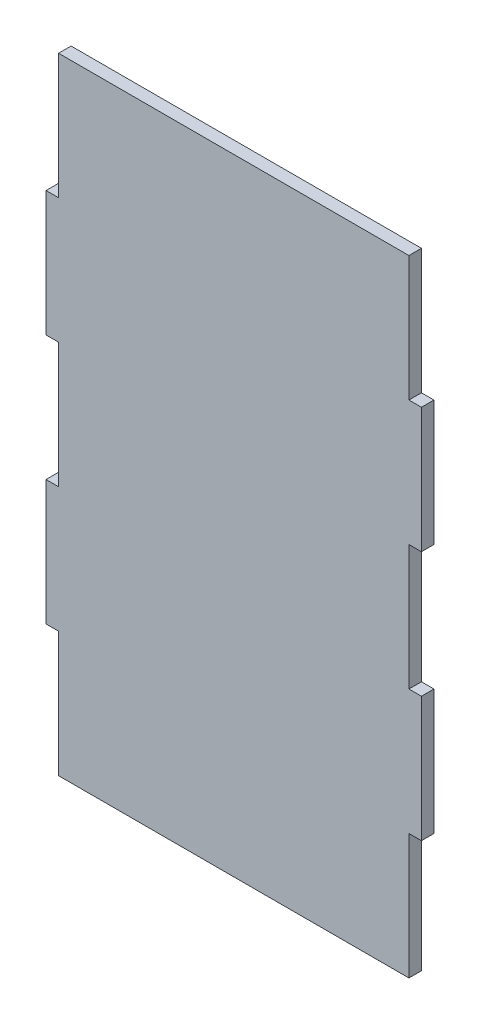
ISO-10303-21;
HEADER;
FILE_DESCRIPTION(('STEP AP214'),'2;1');
FILE_NAME('part.step','',(''),(''),'','','');
FILE_SCHEMA(('AUTOMOTIVE_DESIGN { 1 0 10303 214 1 1 1 1 }'));
ENDSEC;
DATA;
#1=APPLICATION_CONTEXT('core data for automotive mechanical design processes');
#2=APPLICATION_PROTOCOL_DEFINITION('international standard','automotive_design',2000,#1);
#3=PRODUCT_CONTEXT('',#1,'mechanical');
#4=PRODUCT('Part','Part','',(#3));
#5=PRODUCT_RELATED_PRODUCT_CATEGORY('part','',(#4));
#6=PRODUCT_DEFINITION_FORMATION('','',#4);
#7=PRODUCT_DEFINITION_CONTEXT('part definition',#1,'design');
#8=PRODUCT_DEFINITION('design','',#6,#7);
#9=PRODUCT_DEFINITION_SHAPE('','',#8);
#10=(LENGTH_UNIT() NAMED_UNIT(*) SI_UNIT(.MILLI.,.METRE.));
#11=(NAMED_UNIT(*) PLANE_ANGLE_UNIT() SI_UNIT($,.RADIAN.));
#12=(NAMED_UNIT(*) SI_UNIT($,.STERADIAN.) SOLID_ANGLE_UNIT());
#13=UNCERTAINTY_MEASURE_WITH_UNIT(LENGTH_MEASURE(1.E-05),#10,'distance_accuracy_value','');
#14=(GEOMETRIC_REPRESENTATION_CONTEXT(3) GLOBAL_UNCERTAINTY_ASSIGNED_CONTEXT((#13)) GLOBAL_UNIT_ASSIGNED_CONTEXT((#10,
#11,#12)) REPRESENTATION_CONTEXT('',''));
#15=CARTESIAN_POINT('',(0.,0.,0.));
#16=DIRECTION('',(0.,0.,1.));
#17=DIRECTION('',(1.,0.,0.));
#18=AXIS2_PLACEMENT_3D('',#15,#16,#17);
#19=CARTESIAN_POINT('',(0.,0.,2.54));
#20=DIRECTION('',(0.,0.,1.));
#21=DIRECTION('',(1.,0.,0.));
#22=AXIS2_PLACEMENT_3D('',#19,#20,#21);
#23=PLANE('',#22);
#24=DIRECTION('',(0.,1.,0.));
#25=VECTOR('',#24,1.);
#26=CARTESIAN_POINT('',(76.2,0.,2.54));
#27=LINE('',#26,#25);
#28=CARTESIAN_POINT('',(76.2,76.2,2.54));
#29=VERTEX_POINT('',#28);
#30=CARTESIAN_POINT('',(76.2,101.6,2.54));
#31=VERTEX_POINT('',#30);
#32=EDGE_CURVE('E219',#29,#31,#27,.T.);
#33=ORIENTED_EDGE('',*,*,#32,.T.);
#34=DIRECTION('',(-1.,0.,0.));
#35=VECTOR('',#34,1.);
#36=CARTESIAN_POINT('',(76.2,101.6,2.54));
#37=LINE('',#36,#35);
#38=CARTESIAN_POINT('',(73.66,101.6,2.54));
#39=VERTEX_POINT('',#38);
#40=EDGE_CURVE('E54',#31,#39,#37,.T.);
#41=ORIENTED_EDGE('',*,*,#40,.T.);
#42=DIRECTION('',(0.,-1.,0.));
#43=VECTOR('',#42,1.);
#44=CARTESIAN_POINT('',(73.66,127.,2.54));
#45=LINE('',#44,#43);
#46=CARTESIAN_POINT('',(73.66,127.,2.54));
#47=VERTEX_POINT('',#46);
#48=EDGE_CURVE('E193',#47,#39,#45,.T.);
#49=ORIENTED_EDGE('',*,*,#48,.F.);
#50=DIRECTION('',(1.,0.,0.));
#51=VECTOR('',#50,1.);
#52=CARTESIAN_POINT('',(0.,127.,2.54));
#53=LINE('',#52,#51);
#54=CARTESIAN_POINT('',(2.54,127.,2.54));
#55=VERTEX_POINT('',#54);
#56=EDGE_CURVE('E231',#55,#47,#53,.T.);
#57=ORIENTED_EDGE('',*,*,#56,.F.);
#58=DIRECTION('',(0.,-1.,0.));
#59=VECTOR('',#58,1.);
#60=CARTESIAN_POINT('',(2.54,127.,2.54));
#61=LINE('',#60,#59);
#62=CARTESIAN_POINT('',(2.54,101.6,2.54));
#63=VERTEX_POINT('',#62);
#64=EDGE_CURVE('E252',#55,#63,#61,.T.);
#65=ORIENTED_EDGE('',*,*,#64,.T.);
#66=DIRECTION('',(1.,0.,0.));
#67=VECTOR('',#66,1.);
#68=CARTESIAN_POINT('',(0.,101.6,2.54));
#69=LINE('',#68,#67);
#70=CARTESIAN_POINT('',(0.,101.6,2.54));
#71=VERTEX_POINT('',#70);
#72=EDGE_CURVE('E246',#71,#63,#69,.T.);
#73=ORIENTED_EDGE('',*,*,#72,.F.);
#74=DIRECTION('',(0.,1.,0.));
#75=VECTOR('',#74,1.);
#76=CARTESIAN_POINT('',(0.,0.,2.54));
#77=LINE('',#76,#75);
#78=CARTESIAN_POINT('',(0.,76.2,2.54));
#79=VERTEX_POINT('',#78);
#80=EDGE_CURVE('E46',#79,#71,#77,.T.);
#81=ORIENTED_EDGE('',*,*,#80,.F.);
#82=DIRECTION('',(1.,0.,0.));
#83=VECTOR('',#82,1.);
#84=CARTESIAN_POINT('',(0.,76.2,2.54));
#85=LINE('',#84,#83);
#86=CARTESIAN_POINT('',(2.54,76.2,2.54));
#87=VERTEX_POINT('',#86);
#88=EDGE_CURVE('E323',#79,#87,#85,.T.);
#89=ORIENTED_EDGE('',*,*,#88,.T.);
#90=DIRECTION('',(0.,-1.,0.));
#91=VECTOR('',#90,1.);
#92=CARTESIAN_POINT('',(2.54,76.2,2.54));
#93=LINE('',#92,#91);
#94=CARTESIAN_POINT('',(2.54,50.8,2.54));
#95=VERTEX_POINT('',#94);
#96=EDGE_CURVE('E332',#87,#95,#93,.T.);
#97=ORIENTED_EDGE('',*,*,#96,.T.);
#98=DIRECTION('',(1.,0.,0.));
#99=VECTOR('',#98,1.);
#100=CARTESIAN_POINT('',(0.,50.8,2.54));
#101=LINE('',#100,#99);
#102=CARTESIAN_POINT('',(0.,50.8,2.54));
#103=VERTEX_POINT('',#102);
#104=EDGE_CURVE('E277',#103,#95,#101,.T.);
#105=ORIENTED_EDGE('',*,*,#104,.F.);
#106=CARTESIAN_POINT('',(0.,25.4,2.54));
#107=VERTEX_POINT('',#106);
#108=EDGE_CURVE('E11',#107,#103,#77,.T.);
#109=ORIENTED_EDGE('',*,*,#108,.F.);
#110=DIRECTION('',(1.,0.,0.));
#111=VECTOR('',#110,1.);
#112=CARTESIAN_POINT('',(0.,25.4,2.54));
#113=LINE('',#112,#111);
#114=CARTESIAN_POINT('',(2.54,25.4,2.54));
#115=VERTEX_POINT('',#114);
#116=EDGE_CURVE('E274',#107,#115,#113,.T.);
#117=ORIENTED_EDGE('',*,*,#116,.T.);
#118=DIRECTION('',(0.,1.,0.));
#119=VECTOR('',#118,1.);
#120=CARTESIAN_POINT('',(2.54,0.,2.54));
#121=LINE('',#120,#119);
#122=CARTESIAN_POINT('',(2.54,0.,2.54));
#123=VERTEX_POINT('',#122);
#124=EDGE_CURVE('E270',#123,#115,#121,.T.);
#125=ORIENTED_EDGE('',*,*,#124,.F.);
#126=DIRECTION('',(1.,0.,0.));
#127=VECTOR('',#126,1.);
#128=CARTESIAN_POINT('',(0.,0.,2.54));
#129=LINE('',#128,#127);
#130=CARTESIAN_POINT('',(73.66,0.,2.54));
#131=VERTEX_POINT('',#130);
#132=EDGE_CURVE('E214',#123,#131,#129,.T.);
#133=ORIENTED_EDGE('',*,*,#132,.T.);
#134=DIRECTION('',(0.,1.,0.));
#135=VECTOR('',#134,1.);
#136=CARTESIAN_POINT('',(73.66,0.,2.54));
#137=LINE('',#136,#135);
#138=CARTESIAN_POINT('',(73.66,25.4,2.54));
#139=VERTEX_POINT('',#138);
#140=EDGE_CURVE('E285',#131,#139,#137,.T.);
#141=ORIENTED_EDGE('',*,*,#140,.T.);
#142=DIRECTION('',(-1.,0.,0.));
#143=VECTOR('',#142,1.);
#144=CARTESIAN_POINT('',(76.2,25.4,2.54));
#145=LINE('',#144,#143);
#146=CARTESIAN_POINT('',(76.2,25.4,2.54));
#147=VERTEX_POINT('',#146);
#148=EDGE_CURVE('E289',#147,#139,#145,.T.);
#149=ORIENTED_EDGE('',*,*,#148,.F.);
#150=CARTESIAN_POINT('',(76.2,50.8,2.54));
#151=VERTEX_POINT('',#150);
#152=EDGE_CURVE('E225',#147,#151,#27,.T.);
#153=ORIENTED_EDGE('',*,*,#152,.T.);
#154=DIRECTION('',(-1.,0.,0.));
#155=VECTOR('',#154,1.);
#156=CARTESIAN_POINT('',(76.2,50.8,2.54));
#157=LINE('',#156,#155);
#158=CARTESIAN_POINT('',(73.66,50.8,2.54));
#159=VERTEX_POINT('',#158);
#160=EDGE_CURVE('E300',#151,#159,#157,.T.);
#161=ORIENTED_EDGE('',*,*,#160,.T.);
#162=DIRECTION('',(0.,1.,0.));
#163=VECTOR('',#162,1.);
#164=CARTESIAN_POINT('',(73.66,50.8,2.54));
#165=LINE('',#164,#163);
#166=CARTESIAN_POINT('',(73.66,76.2,2.54));
#167=VERTEX_POINT('',#166);
#168=EDGE_CURVE('E310',#159,#167,#165,.T.);
#169=ORIENTED_EDGE('',*,*,#168,.T.);
#170=DIRECTION('',(-1.,0.,0.));
#171=VECTOR('',#170,1.);
#172=CARTESIAN_POINT('',(76.2,76.2,2.54));
#173=LINE('',#172,#171);
#174=EDGE_CURVE('E306',#29,#167,#173,.T.);
#175=ORIENTED_EDGE('',*,*,#174,.F.);
#176=EDGE_LOOP('',(#33,#41,#49,#57,#65,#73,#81,#89,#97,#105,#109,#117,#125,#133,#141,#149,#153,
#161,#169,#175));
#177=FACE_BOUND('',#176,.T.);
#178=ADVANCED_FACE('F37',(#177),#23,.T.);
#179=CARTESIAN_POINT('',(0.,0.,0.));
#180=DIRECTION('',(0.,0.,1.));
#181=DIRECTION('',(1.,0.,0.));
#182=AXIS2_PLACEMENT_3D('',#179,#180,#181);
#183=PLANE('',#182);
#184=DIRECTION('',(-1.,0.,0.));
#185=VECTOR('',#184,1.);
#186=CARTESIAN_POINT('',(76.2,101.6,0.));
#187=LINE('',#186,#185);
#188=CARTESIAN_POINT('',(76.2,101.6,0.));
#189=VERTEX_POINT('',#188);
#190=CARTESIAN_POINT('',(73.66,101.6,0.));
#191=VERTEX_POINT('',#190);
#192=EDGE_CURVE('E176',#189,#191,#187,.T.);
#193=ORIENTED_EDGE('',*,*,#192,.F.);
#194=DIRECTION('',(0.,1.,0.));
#195=VECTOR('',#194,1.);
#196=CARTESIAN_POINT('',(76.2,0.,0.));
#197=LINE('',#196,#195);
#198=CARTESIAN_POINT('',(76.2,76.2,0.));
#199=VERTEX_POINT('',#198);
#200=EDGE_CURVE('E190',#199,#189,#197,.T.);
#201=ORIENTED_EDGE('',*,*,#200,.F.);
#202=DIRECTION('',(-1.,0.,0.));
#203=VECTOR('',#202,1.);
#204=CARTESIAN_POINT('',(76.2,76.2,0.));
#205=LINE('',#204,#203);
#206=CARTESIAN_POINT('',(73.66,76.2,0.));
#207=VERTEX_POINT('',#206);
#208=EDGE_CURVE('E298',#199,#207,#205,.T.);
#209=ORIENTED_EDGE('',*,*,#208,.T.);
#210=DIRECTION('',(0.,1.,0.));
#211=VECTOR('',#210,1.);
#212=CARTESIAN_POINT('',(73.66,50.8,0.));
#213=LINE('',#212,#211);
#214=CARTESIAN_POINT('',(73.66,50.8,0.));
#215=VERTEX_POINT('',#214);
#216=EDGE_CURVE('E301',#215,#207,#213,.T.);
#217=ORIENTED_EDGE('',*,*,#216,.F.);
#218=DIRECTION('',(-1.,0.,0.));
#219=VECTOR('',#218,1.);
#220=CARTESIAN_POINT('',(76.2,50.8,0.));
#221=LINE('',#220,#219);
#222=CARTESIAN_POINT('',(76.2,50.8,0.));
#223=VERTEX_POINT('',#222);
#224=EDGE_CURVE('E303',#223,#215,#221,.T.);
#225=ORIENTED_EDGE('',*,*,#224,.F.);
#226=CARTESIAN_POINT('',(76.2,25.4,0.));
#227=VERTEX_POINT('',#226);
#228=EDGE_CURVE('E198',#227,#223,#197,.T.);
#229=ORIENTED_EDGE('',*,*,#228,.F.);
#230=DIRECTION('',(-1.,0.,0.));
#231=VECTOR('',#230,1.);
#232=CARTESIAN_POINT('',(76.2,25.4,0.));
#233=LINE('',#232,#231);
#234=CARTESIAN_POINT('',(73.66,25.4,0.));
#235=VERTEX_POINT('',#234);
#236=EDGE_CURVE('E282',#227,#235,#233,.T.);
#237=ORIENTED_EDGE('',*,*,#236,.T.);
#238=DIRECTION('',(0.,1.,0.));
#239=VECTOR('',#238,1.);
#240=CARTESIAN_POINT('',(73.66,0.,0.));
#241=LINE('',#240,#239);
#242=CARTESIAN_POINT('',(73.66,0.,0.));
#243=VERTEX_POINT('',#242);
#244=EDGE_CURVE('E286',#243,#235,#241,.T.);
#245=ORIENTED_EDGE('',*,*,#244,.F.);
#246=DIRECTION('',(1.,0.,0.));
#247=VECTOR('',#246,1.);
#248=CARTESIAN_POINT('',(0.,0.,0.));
#249=LINE('',#248,#247);
#250=CARTESIAN_POINT('',(2.54,0.,0.));
#251=VERTEX_POINT('',#250);
#252=EDGE_CURVE('E199',#251,#243,#249,.T.);
#253=ORIENTED_EDGE('',*,*,#252,.F.);
#254=DIRECTION('',(0.,1.,0.));
#255=VECTOR('',#254,1.);
#256=CARTESIAN_POINT('',(2.54,0.,0.));
#257=LINE('',#256,#255);
#258=CARTESIAN_POINT('',(2.54,25.4,0.));
#259=VERTEX_POINT('',#258);
#260=EDGE_CURVE('E269',#251,#259,#257,.T.);
#261=ORIENTED_EDGE('',*,*,#260,.T.);
#262=DIRECTION('',(1.,0.,0.));
#263=VECTOR('',#262,1.);
#264=CARTESIAN_POINT('',(0.,25.4,0.));
#265=LINE('',#264,#263);
#266=CARTESIAN_POINT('',(0.,25.4,0.));
#267=VERTEX_POINT('',#266);
#268=EDGE_CURVE('E273',#267,#259,#265,.T.);
#269=ORIENTED_EDGE('',*,*,#268,.F.);
#270=DIRECTION('',(0.,1.,0.));
#271=VECTOR('',#270,1.);
#272=CARTESIAN_POINT('',(0.,0.,0.));
#273=LINE('',#272,#271);
#274=CARTESIAN_POINT('',(0.,50.8,0.));
#275=VERTEX_POINT('',#274);
#276=EDGE_CURVE('E208',#267,#275,#273,.T.);
#277=ORIENTED_EDGE('',*,*,#276,.T.);
#278=DIRECTION('',(1.,0.,0.));
#279=VECTOR('',#278,1.);
#280=CARTESIAN_POINT('',(0.,50.8,0.));
#281=LINE('',#280,#279);
#282=CARTESIAN_POINT('',(2.54,50.8,0.));
#283=VERTEX_POINT('',#282);
#284=EDGE_CURVE('E321',#275,#283,#281,.T.);
#285=ORIENTED_EDGE('',*,*,#284,.T.);
#286=DIRECTION('',(0.,-1.,0.));
#287=VECTOR('',#286,1.);
#288=CARTESIAN_POINT('',(2.54,76.2,0.));
#289=LINE('',#288,#287);
#290=CARTESIAN_POINT('',(2.54,76.2,0.));
#291=VERTEX_POINT('',#290);
#292=EDGE_CURVE('E324',#291,#283,#289,.T.);
#293=ORIENTED_EDGE('',*,*,#292,.F.);
#294=DIRECTION('',(1.,0.,0.));
#295=VECTOR('',#294,1.);
#296=CARTESIAN_POINT('',(0.,76.2,0.));
#297=LINE('',#296,#295);
#298=CARTESIAN_POINT('',(0.,76.2,0.));
#299=VERTEX_POINT('',#298);
#300=EDGE_CURVE('E326',#299,#291,#297,.T.);
#301=ORIENTED_EDGE('',*,*,#300,.F.);
#302=CARTESIAN_POINT('',(0.,101.6,0.));
#303=VERTEX_POINT('',#302);
#304=EDGE_CURVE('E41',#299,#303,#273,.T.);
#305=ORIENTED_EDGE('',*,*,#304,.T.);
#306=DIRECTION('',(1.,0.,0.));
#307=VECTOR('',#306,1.);
#308=CARTESIAN_POINT('',(0.,101.6,0.));
#309=LINE('',#308,#307);
#310=CARTESIAN_POINT('',(2.54,101.6,0.));
#311=VERTEX_POINT('',#310);
#312=EDGE_CURVE('E248',#303,#311,#309,.T.);
#313=ORIENTED_EDGE('',*,*,#312,.T.);
#314=DIRECTION('',(0.,-1.,0.));
#315=VECTOR('',#314,1.);
#316=CARTESIAN_POINT('',(2.54,127.,0.));
#317=LINE('',#316,#315);
#318=CARTESIAN_POINT('',(2.54,127.,0.));
#319=VERTEX_POINT('',#318);
#320=EDGE_CURVE('E259',#319,#311,#317,.T.);
#321=ORIENTED_EDGE('',*,*,#320,.F.);
#322=DIRECTION('',(1.,0.,0.));
#323=VECTOR('',#322,1.);
#324=CARTESIAN_POINT('',(0.,127.,0.));
#325=LINE('',#324,#323);
#326=CARTESIAN_POINT('',(73.66,127.,0.));
#327=VERTEX_POINT('',#326);
#328=EDGE_CURVE('E202',#319,#327,#325,.T.);
#329=ORIENTED_EDGE('',*,*,#328,.T.);
#330=DIRECTION('',(0.,-1.,0.));
#331=VECTOR('',#330,1.);
#332=CARTESIAN_POINT('',(73.66,127.,0.));
#333=LINE('',#332,#331);
#334=EDGE_CURVE('E192',#327,#191,#333,.T.);
#335=ORIENTED_EDGE('',*,*,#334,.T.);
#336=EDGE_LOOP('',(#193,#201,#209,#217,#225,#229,#237,#245,#253,#261,#269,#277,#285,#293,#301,
#305,#313,#321,#329,#335));
#337=FACE_BOUND('',#336,.T.);
#338=ADVANCED_FACE('F188',(#337),#183,.F.);
#339=CARTESIAN_POINT('',(76.2,0.,2.54));
#340=DIRECTION('',(-1.,0.,0.));
#341=DIRECTION('',(0.,-1.,0.));
#342=AXIS2_PLACEMENT_3D('',#339,#340,#341);
#343=PLANE('',#342);
#344=DIRECTION('',(0.,0.,1.));
#345=VECTOR('',#344,1.);
#346=CARTESIAN_POINT('',(76.2,101.6,0.));
#347=LINE('',#346,#345);
#348=EDGE_CURVE('E173',#189,#31,#347,.T.);
#349=ORIENTED_EDGE('',*,*,#348,.T.);
#350=ORIENTED_EDGE('',*,*,#32,.F.);
#351=DIRECTION('',(0.,0.,1.));
#352=VECTOR('',#351,1.);
#353=CARTESIAN_POINT('',(76.2,76.2,0.));
#354=LINE('',#353,#352);
#355=EDGE_CURVE('E197',#199,#29,#354,.T.);
#356=ORIENTED_EDGE('',*,*,#355,.F.);
#357=ORIENTED_EDGE('',*,*,#200,.T.);
#358=EDGE_LOOP('',(#349,#350,#356,#357));
#359=FACE_BOUND('',#358,.T.);
#360=ADVANCED_FACE('F196',(#359),#343,.F.);
#361=CARTESIAN_POINT('',(0.,0.,2.54));
#362=DIRECTION('',(0.,1.,0.));
#363=DIRECTION('',(0.,0.,1.));
#364=AXIS2_PLACEMENT_3D('',#361,#362,#363);
#365=PLANE('',#364);
#366=DIRECTION('',(0.,0.,1.));
#367=VECTOR('',#366,1.);
#368=CARTESIAN_POINT('',(73.66,0.,0.));
#369=LINE('',#368,#367);
#370=EDGE_CURVE('E294',#243,#131,#369,.T.);
#371=ORIENTED_EDGE('',*,*,#370,.T.);
#372=ORIENTED_EDGE('',*,*,#132,.F.);
#373=DIRECTION('',(0.,0.,1.));
#374=VECTOR('',#373,1.);
#375=CARTESIAN_POINT('',(2.54,0.,0.));
#376=LINE('',#375,#374);
#377=EDGE_CURVE('E256',#251,#123,#376,.T.);
#378=ORIENTED_EDGE('',*,*,#377,.F.);
#379=ORIENTED_EDGE('',*,*,#252,.T.);
#380=EDGE_LOOP('',(#371,#372,#378,#379));
#381=FACE_BOUND('',#380,.T.);
#382=ADVANCED_FACE('F39',(#381),#365,.F.);
#383=ORIENTED_EDGE('',*,*,#152,.F.);
#384=DIRECTION('',(0.,0.,1.));
#385=VECTOR('',#384,1.);
#386=CARTESIAN_POINT('',(76.2,25.4,0.));
#387=LINE('',#386,#385);
#388=EDGE_CURVE('E182',#227,#147,#387,.T.);
#389=ORIENTED_EDGE('',*,*,#388,.F.);
#390=ORIENTED_EDGE('',*,*,#228,.T.);
#391=DIRECTION('',(0.,0.,1.));
#392=VECTOR('',#391,1.);
#393=CARTESIAN_POINT('',(76.2,50.8,0.));
#394=LINE('',#393,#392);
#395=EDGE_CURVE('E316',#223,#151,#394,.T.);
#396=ORIENTED_EDGE('',*,*,#395,.T.);
#397=EDGE_LOOP('',(#383,#389,#390,#396));
#398=FACE_BOUND('',#397,.T.);
#399=ADVANCED_FACE('F362',(#398),#343,.F.);
#400=CARTESIAN_POINT('',(0.,0.,2.54));
#401=DIRECTION('',(-1.,0.,0.));
#402=DIRECTION('',(0.,-1.,0.));
#403=AXIS2_PLACEMENT_3D('',#400,#401,#402);
#404=PLANE('',#403);
#405=ORIENTED_EDGE('',*,*,#304,.F.);
#406=DIRECTION('',(0.,0.,1.));
#407=VECTOR('',#406,1.);
#408=CARTESIAN_POINT('',(0.,76.2,0.));
#409=LINE('',#408,#407);
#410=EDGE_CURVE('E239',#299,#79,#409,.T.);
#411=ORIENTED_EDGE('',*,*,#410,.T.);
#412=ORIENTED_EDGE('',*,*,#80,.T.);
#413=DIRECTION('',(0.,0.,1.));
#414=VECTOR('',#413,1.);
#415=CARTESIAN_POINT('',(0.,101.6,0.));
#416=LINE('',#415,#414);
#417=EDGE_CURVE('E204',#303,#71,#416,.T.);
#418=ORIENTED_EDGE('',*,*,#417,.F.);
#419=EDGE_LOOP('',(#405,#411,#412,#418));
#420=FACE_BOUND('',#419,.T.);
#421=ADVANCED_FACE('F238',(#420),#404,.T.);
#422=DIRECTION('',(0.,0.,1.));
#423=VECTOR('',#422,1.);
#424=CARTESIAN_POINT('',(0.,50.8,0.));
#425=LINE('',#424,#423);
#426=EDGE_CURVE('E309',#275,#103,#425,.T.);
#427=ORIENTED_EDGE('',*,*,#426,.F.);
#428=ORIENTED_EDGE('',*,*,#276,.F.);
#429=DIRECTION('',(0.,0.,1.));
#430=VECTOR('',#429,1.);
#431=CARTESIAN_POINT('',(0.,25.4,0.));
#432=LINE('',#431,#430);
#433=EDGE_CURVE('E266',#267,#107,#432,.T.);
#434=ORIENTED_EDGE('',*,*,#433,.T.);
#435=ORIENTED_EDGE('',*,*,#108,.T.);
#436=EDGE_LOOP('',(#427,#428,#434,#435));
#437=FACE_BOUND('',#436,.T.);
#438=ADVANCED_FACE('F380',(#437),#404,.T.);
#439=CARTESIAN_POINT('',(0.,127.,2.54));
#440=DIRECTION('',(0.,1.,0.));
#441=DIRECTION('',(0.,0.,1.));
#442=AXIS2_PLACEMENT_3D('',#439,#440,#441);
#443=PLANE('',#442);
#444=DIRECTION('',(0.,0.,1.));
#445=VECTOR('',#444,1.);
#446=CARTESIAN_POINT('',(73.66,127.,0.));
#447=LINE('',#446,#445);
#448=EDGE_CURVE('E342',#327,#47,#447,.T.);
#449=ORIENTED_EDGE('',*,*,#448,.F.);
#450=ORIENTED_EDGE('',*,*,#328,.F.);
#451=DIRECTION('',(0.,0.,1.));
#452=VECTOR('',#451,1.);
#453=CARTESIAN_POINT('',(2.54,127.,0.));
#454=LINE('',#453,#452);
#455=EDGE_CURVE('E249',#319,#55,#454,.T.);
#456=ORIENTED_EDGE('',*,*,#455,.T.);
#457=ORIENTED_EDGE('',*,*,#56,.T.);
#458=EDGE_LOOP('',(#449,#450,#456,#457));
#459=FACE_BOUND('',#458,.T.);
#460=ADVANCED_FACE('F411',(#459),#443,.T.);
#461=CARTESIAN_POINT('',(0.,101.6,0.));
#462=DIRECTION('',(0.,-1.,0.));
#463=DIRECTION('',(0.,0.,-1.));
#464=AXIS2_PLACEMENT_3D('',#461,#462,#463);
#465=PLANE('',#464);
#466=ORIENTED_EDGE('',*,*,#72,.T.);
#467=DIRECTION('',(0.,0.,1.));
#468=VECTOR('',#467,1.);
#469=CARTESIAN_POINT('',(2.54,101.6,0.));
#470=LINE('',#469,#468);
#471=EDGE_CURVE('E228',#311,#63,#470,.T.);
#472=ORIENTED_EDGE('',*,*,#471,.F.);
#473=ORIENTED_EDGE('',*,*,#312,.F.);
#474=ORIENTED_EDGE('',*,*,#417,.T.);
#475=EDGE_LOOP('',(#466,#472,#473,#474));
#476=FACE_BOUND('',#475,.T.);
#477=ADVANCED_FACE('F244',(#476),#465,.F.);
#478=CARTESIAN_POINT('',(2.54,127.,0.));
#479=DIRECTION('',(-1.,0.,0.));
#480=DIRECTION('',(0.,-1.,0.));
#481=AXIS2_PLACEMENT_3D('',#478,#479,#480);
#482=PLANE('',#481);
#483=ORIENTED_EDGE('',*,*,#64,.F.);
#484=ORIENTED_EDGE('',*,*,#455,.F.);
#485=ORIENTED_EDGE('',*,*,#320,.T.);
#486=ORIENTED_EDGE('',*,*,#471,.T.);
#487=EDGE_LOOP('',(#483,#484,#485,#486));
#488=FACE_BOUND('',#487,.T.);
#489=ADVANCED_FACE('F443',(#488),#482,.T.);
#490=CARTESIAN_POINT('',(0.,25.4,0.));
#491=DIRECTION('',(0.,-1.,0.));
#492=DIRECTION('',(0.,0.,-1.));
#493=AXIS2_PLACEMENT_3D('',#490,#491,#492);
#494=PLANE('',#493);
#495=ORIENTED_EDGE('',*,*,#116,.F.);
#496=ORIENTED_EDGE('',*,*,#433,.F.);
#497=ORIENTED_EDGE('',*,*,#268,.T.);
#498=DIRECTION('',(0.,0.,1.));
#499=VECTOR('',#498,1.);
#500=CARTESIAN_POINT('',(2.54,25.4,0.));
#501=LINE('',#500,#499);
#502=EDGE_CURVE('E253',#259,#115,#501,.T.);
#503=ORIENTED_EDGE('',*,*,#502,.T.);
#504=EDGE_LOOP('',(#495,#496,#497,#503));
#505=FACE_BOUND('',#504,.T.);
#506=ADVANCED_FACE('F376',(#505),#494,.T.);
#507=CARTESIAN_POINT('',(2.54,0.,0.));
#508=DIRECTION('',(1.,0.,0.));
#509=DIRECTION('',(0.,1.,0.));
#510=AXIS2_PLACEMENT_3D('',#507,#508,#509);
#511=PLANE('',#510);
#512=ORIENTED_EDGE('',*,*,#124,.T.);
#513=ORIENTED_EDGE('',*,*,#502,.F.);
#514=ORIENTED_EDGE('',*,*,#260,.F.);
#515=ORIENTED_EDGE('',*,*,#377,.T.);
#516=EDGE_LOOP('',(#512,#513,#514,#515));
#517=FACE_BOUND('',#516,.T.);
#518=ADVANCED_FACE('F374',(#517),#511,.F.);
#519=CARTESIAN_POINT('',(0.,50.8,0.));
#520=DIRECTION('',(0.,-1.,0.));
#521=DIRECTION('',(0.,0.,-1.));
#522=AXIS2_PLACEMENT_3D('',#519,#520,#521);
#523=PLANE('',#522);
#524=ORIENTED_EDGE('',*,*,#104,.T.);
#525=DIRECTION('',(0.,0.,1.));
#526=VECTOR('',#525,1.);
#527=CARTESIAN_POINT('',(2.54,50.8,0.));
#528=LINE('',#527,#526);
#529=EDGE_CURVE('E329',#283,#95,#528,.T.);
#530=ORIENTED_EDGE('',*,*,#529,.F.);
#531=ORIENTED_EDGE('',*,*,#284,.F.);
#532=ORIENTED_EDGE('',*,*,#426,.T.);
#533=EDGE_LOOP('',(#524,#530,#531,#532));
#534=FACE_BOUND('',#533,.T.);
#535=ADVANCED_FACE('F385',(#534),#523,.F.);
#536=CARTESIAN_POINT('',(0.,76.2,0.));
#537=DIRECTION('',(0.,-1.,0.));
#538=DIRECTION('',(0.,0.,-1.));
#539=AXIS2_PLACEMENT_3D('',#536,#537,#538);
#540=PLANE('',#539);
#541=ORIENTED_EDGE('',*,*,#88,.F.);
#542=ORIENTED_EDGE('',*,*,#410,.F.);
#543=ORIENTED_EDGE('',*,*,#300,.T.);
#544=DIRECTION('',(0.,0.,1.));
#545=VECTOR('',#544,1.);
#546=CARTESIAN_POINT('',(2.54,76.2,0.));
#547=LINE('',#546,#545);
#548=EDGE_CURVE('E338',#291,#87,#547,.T.);
#549=ORIENTED_EDGE('',*,*,#548,.T.);
#550=EDGE_LOOP('',(#541,#542,#543,#549));
#551=FACE_BOUND('',#550,.T.);
#552=ADVANCED_FACE('F390',(#551),#540,.T.);
#553=CARTESIAN_POINT('',(2.54,76.2,0.));
#554=DIRECTION('',(-1.,0.,0.));
#555=DIRECTION('',(0.,-1.,0.));
#556=AXIS2_PLACEMENT_3D('',#553,#554,#555);
#557=PLANE('',#556);
#558=ORIENTED_EDGE('',*,*,#96,.F.);
#559=ORIENTED_EDGE('',*,*,#548,.F.);
#560=ORIENTED_EDGE('',*,*,#292,.T.);
#561=ORIENTED_EDGE('',*,*,#529,.T.);
#562=EDGE_LOOP('',(#558,#559,#560,#561));
#563=FACE_BOUND('',#562,.T.);
#564=ADVANCED_FACE('F388',(#563),#557,.T.);
#565=CARTESIAN_POINT('',(76.2,76.2,0.));
#566=DIRECTION('',(0.,1.,0.));
#567=DIRECTION('',(0.,0.,1.));
#568=AXIS2_PLACEMENT_3D('',#565,#566,#567);
#569=PLANE('',#568);
#570=ORIENTED_EDGE('',*,*,#174,.T.);
#571=DIRECTION('',(0.,0.,1.));
#572=VECTOR('',#571,1.);
#573=CARTESIAN_POINT('',(73.66,76.2,0.));
#574=LINE('',#573,#572);
#575=EDGE_CURVE('E305',#207,#167,#574,.T.);
#576=ORIENTED_EDGE('',*,*,#575,.F.);
#577=ORIENTED_EDGE('',*,*,#208,.F.);
#578=ORIENTED_EDGE('',*,*,#355,.T.);
#579=EDGE_LOOP('',(#570,#576,#577,#578));
#580=FACE_BOUND('',#579,.T.);
#581=ADVANCED_FACE('F351',(#580),#569,.F.);
#582=CARTESIAN_POINT('',(76.2,50.8,0.));
#583=DIRECTION('',(0.,1.,0.));
#584=DIRECTION('',(0.,0.,1.));
#585=AXIS2_PLACEMENT_3D('',#582,#583,#584);
#586=PLANE('',#585);
#587=ORIENTED_EDGE('',*,*,#160,.F.);
#588=ORIENTED_EDGE('',*,*,#395,.F.);
#589=ORIENTED_EDGE('',*,*,#224,.T.);
#590=DIRECTION('',(0.,0.,1.));
#591=VECTOR('',#590,1.);
#592=CARTESIAN_POINT('',(73.66,50.8,0.));
#593=LINE('',#592,#591);
#594=EDGE_CURVE('E62',#215,#159,#593,.T.);
#595=ORIENTED_EDGE('',*,*,#594,.T.);
#596=EDGE_LOOP('',(#587,#588,#589,#595));
#597=FACE_BOUND('',#596,.T.);
#598=ADVANCED_FACE('F360',(#597),#586,.T.);
#599=CARTESIAN_POINT('',(73.66,50.8,0.));
#600=DIRECTION('',(1.,0.,0.));
#601=DIRECTION('',(0.,0.,-1.));
#602=AXIS2_PLACEMENT_3D('',#599,#600,#601);
#603=PLANE('',#602);
#604=ORIENTED_EDGE('',*,*,#168,.F.);
#605=ORIENTED_EDGE('',*,*,#594,.F.);
#606=ORIENTED_EDGE('',*,*,#216,.T.);
#607=ORIENTED_EDGE('',*,*,#575,.T.);
#608=EDGE_LOOP('',(#604,#605,#606,#607));
#609=FACE_BOUND('',#608,.T.);
#610=ADVANCED_FACE('F355',(#609),#603,.T.);
#611=CARTESIAN_POINT('',(76.2,25.4,0.));
#612=DIRECTION('',(0.,1.,0.));
#613=DIRECTION('',(0.,0.,1.));
#614=AXIS2_PLACEMENT_3D('',#611,#612,#613);
#615=PLANE('',#614);
#616=ORIENTED_EDGE('',*,*,#148,.T.);
#617=DIRECTION('',(0.,0.,1.));
#618=VECTOR('',#617,1.);
#619=CARTESIAN_POINT('',(73.66,25.4,0.));
#620=LINE('',#619,#618);
#621=EDGE_CURVE('E288',#235,#139,#620,.T.);
#622=ORIENTED_EDGE('',*,*,#621,.F.);
#623=ORIENTED_EDGE('',*,*,#236,.F.);
#624=ORIENTED_EDGE('',*,*,#388,.T.);
#625=EDGE_LOOP('',(#616,#622,#623,#624));
#626=FACE_BOUND('',#625,.T.);
#627=ADVANCED_FACE('F368',(#626),#615,.F.);
#628=CARTESIAN_POINT('',(73.66,0.,0.));
#629=DIRECTION('',(1.,0.,0.));
#630=DIRECTION('',(0.,0.,-1.));
#631=AXIS2_PLACEMENT_3D('',#628,#629,#630);
#632=PLANE('',#631);
#633=ORIENTED_EDGE('',*,*,#140,.F.);
#634=ORIENTED_EDGE('',*,*,#370,.F.);
#635=ORIENTED_EDGE('',*,*,#244,.T.);
#636=ORIENTED_EDGE('',*,*,#621,.T.);
#637=EDGE_LOOP('',(#633,#634,#635,#636));
#638=FACE_BOUND('',#637,.T.);
#639=ADVANCED_FACE('F370',(#638),#632,.T.);
#640=CARTESIAN_POINT('',(76.2,101.6,0.));
#641=DIRECTION('',(0.,1.,0.));
#642=DIRECTION('',(0.,0.,1.));
#643=AXIS2_PLACEMENT_3D('',#640,#641,#642);
#644=PLANE('',#643);
#645=ORIENTED_EDGE('',*,*,#40,.F.);
#646=ORIENTED_EDGE('',*,*,#348,.F.);
#647=ORIENTED_EDGE('',*,*,#192,.T.);
#648=DIRECTION('',(0.,0.,1.));
#649=VECTOR('',#648,1.);
#650=CARTESIAN_POINT('',(73.66,101.6,0.));
#651=LINE('',#650,#649);
#652=EDGE_CURVE('E183',#191,#39,#651,.T.);
#653=ORIENTED_EDGE('',*,*,#652,.T.);
#654=EDGE_LOOP('',(#645,#646,#647,#653));
#655=FACE_BOUND('',#654,.T.);
#656=ADVANCED_FACE('F175',(#655),#644,.T.);
#657=CARTESIAN_POINT('',(73.66,127.,0.));
#658=DIRECTION('',(-1.,0.,0.));
#659=DIRECTION('',(0.,0.,1.));
#660=AXIS2_PLACEMENT_3D('',#657,#658,#659);
#661=PLANE('',#660);
#662=ORIENTED_EDGE('',*,*,#48,.T.);
#663=ORIENTED_EDGE('',*,*,#652,.F.);
#664=ORIENTED_EDGE('',*,*,#334,.F.);
#665=ORIENTED_EDGE('',*,*,#448,.T.);
#666=EDGE_LOOP('',(#662,#663,#664,#665));
#667=FACE_BOUND('',#666,.T.);
#668=ADVANCED_FACE('F550',(#667),#661,.F.);
#669=CLOSED_SHELL('',(#178,#338,#360,#382,#399,#421,#438,#460,#477,#489,#506,#518,#535,#552,
#564,#581,#598,#610,#627,#639,#656,#668));
#670=MANIFOLD_SOLID_BREP('B2',#669);
#671=ADVANCED_BREP_SHAPE_REPRESENTATION('',(#18,#670),#14);
#672=SHAPE_DEFINITION_REPRESENTATION(#9,#671);
ENDSEC;
END-ISO-10303-21;
